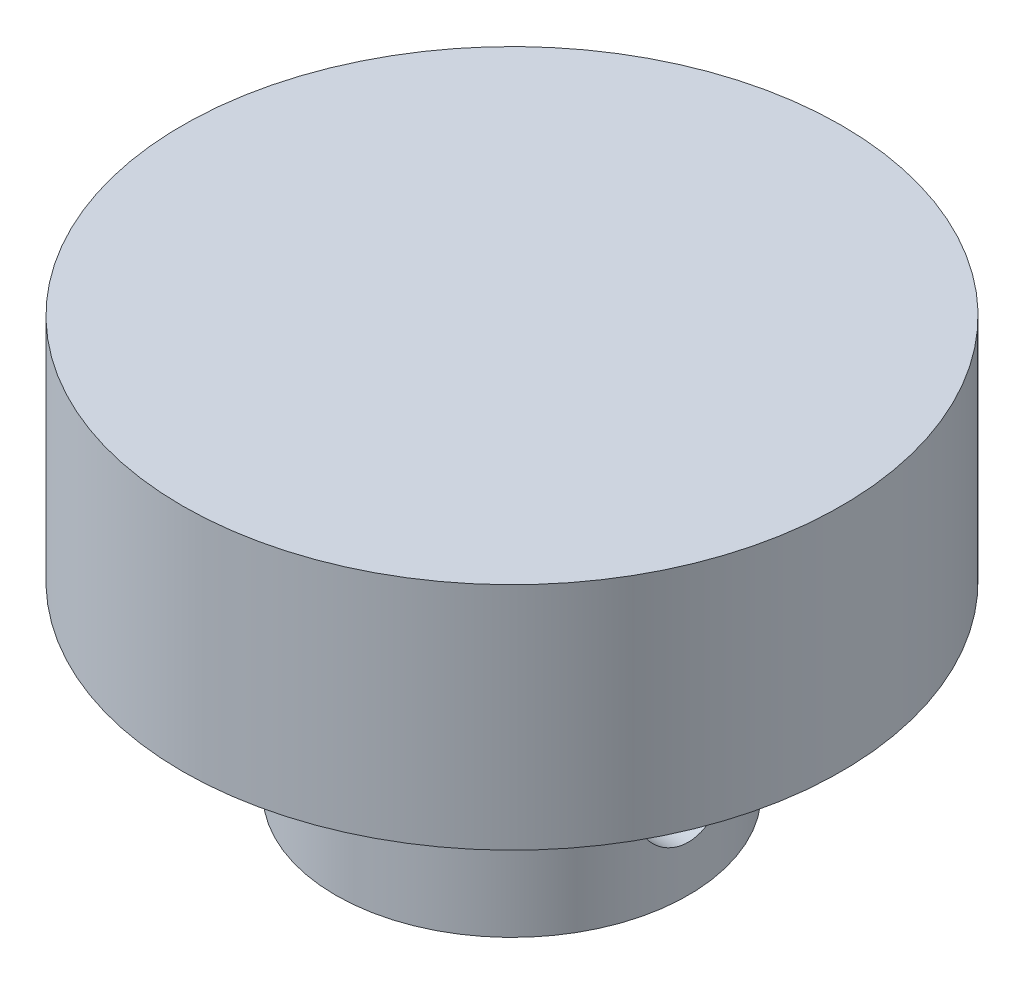
ISO-10303-21;
HEADER;
FILE_DESCRIPTION(('STEP AP214'),'2;1');
FILE_NAME('part.step','',(''),(''),'','','');
FILE_SCHEMA(('AUTOMOTIVE_DESIGN { 1 0 10303 214 1 1 1 1 }'));
ENDSEC;
DATA;
#1=APPLICATION_CONTEXT('core data for automotive mechanical design processes');
#2=APPLICATION_PROTOCOL_DEFINITION('international standard','automotive_design',2000,#1);
#3=PRODUCT_CONTEXT('',#1,'mechanical');
#4=PRODUCT('Part','Part','',(#3));
#5=PRODUCT_RELATED_PRODUCT_CATEGORY('part','',(#4));
#6=PRODUCT_DEFINITION_FORMATION('','',#4);
#7=PRODUCT_DEFINITION_CONTEXT('part definition',#1,'design');
#8=PRODUCT_DEFINITION('design','',#6,#7);
#9=PRODUCT_DEFINITION_SHAPE('','',#8);
#10=(LENGTH_UNIT() NAMED_UNIT(*) SI_UNIT(.MILLI.,.METRE.));
#11=(NAMED_UNIT(*) PLANE_ANGLE_UNIT() SI_UNIT($,.RADIAN.));
#12=(NAMED_UNIT(*) SI_UNIT($,.STERADIAN.) SOLID_ANGLE_UNIT());
#13=UNCERTAINTY_MEASURE_WITH_UNIT(LENGTH_MEASURE(1.E-05),#10,'distance_accuracy_value','');
#14=(GEOMETRIC_REPRESENTATION_CONTEXT(3) GLOBAL_UNCERTAINTY_ASSIGNED_CONTEXT((#13)) GLOBAL_UNIT_ASSIGNED_CONTEXT((#10,
#11,#12)) REPRESENTATION_CONTEXT('',''));
#15=CARTESIAN_POINT('',(0.,0.,0.));
#16=DIRECTION('',(0.,0.,1.));
#17=DIRECTION('',(1.,0.,0.));
#18=AXIS2_PLACEMENT_3D('',#15,#16,#17);
#19=CARTESIAN_POINT('',(0.,0.,0.));
#20=DIRECTION('',(0.,-1.,0.));
#21=DIRECTION('',(0.,0.,-1.));
#22=AXIS2_PLACEMENT_3D('',#19,#20,#21);
#23=CYLINDRICAL_SURFACE('',#22,2.);
#24=CARTESIAN_POINT('',(0.,-27.,0.));
#25=DIRECTION('',(0.,-1.,0.));
#26=DIRECTION('',(0.,0.,-1.));
#27=AXIS2_PLACEMENT_3D('',#24,#25,#26);
#28=CIRCLE('',#27,2.);
#29=CARTESIAN_POINT('',(0.,-27.,-2.));
#30=VERTEX_POINT('',#29);
#31=EDGE_CURVE('E57',#30,#30,#28,.T.);
#32=ORIENTED_EDGE('',*,*,#31,.T.);
#33=EDGE_LOOP('',(#32));
#34=FACE_BOUND('',#33,.T.);
#35=CARTESIAN_POINT('',(0.,-23.2360679774998,-2.));
#36=CARTESIAN_POINT('',(-0.0976283108686207,-23.2360775346282,-1.99999453997731));
#37=CARTESIAN_POINT('',(-0.195290753708801,-23.2425807104744,-1.99278992503664));
#38=CARTESIAN_POINT('',(-0.387119911650814,-23.2673197250162,-1.96458268317731));
#39=CARTESIAN_POINT('',(-0.481280035529566,-23.2855766081271,-1.94355530587862));
#40=CARTESIAN_POINT('',(-0.662735441877684,-23.3305658582557,-1.88935861676632));
#41=CARTESIAN_POINT('',(-0.750087696737658,-23.357215617946,-1.85630718014214));
#42=CARTESIAN_POINT('',(-0.917865832346665,-23.4158409468183,-1.77934008393538));
#43=CARTESIAN_POINT('',(-0.998290269976474,-23.4478176215883,-1.73542216812163));
#44=CARTESIAN_POINT('',(-1.16364688761691,-23.5194607293203,-1.63002410007714));
#45=CARTESIAN_POINT('',(-1.2473321177172,-23.5595493609036,-1.56687435451732));
#46=CARTESIAN_POINT('',(-1.40400270887428,-23.6394482730808,-1.4281921974068));
#47=CARTESIAN_POINT('',(-1.47697752165853,-23.6792582429799,-1.3526477317708));
#48=CARTESIAN_POINT('',(-1.62064365878166,-23.7608881852375,-1.17815690494295));
#49=CARTESIAN_POINT('',(-1.68948251177567,-23.8021678584692,-1.07740643965819));
#50=CARTESIAN_POINT('',(-1.80864209549007,-23.8755848448276,-0.862470964212231));
#51=CARTESIAN_POINT('',(-1.85898351403119,-23.9077323623104,-0.748301152321702));
#52=CARTESIAN_POINT('',(-1.93355640101745,-23.9559990746473,-0.523249073480001));
#53=CARTESIAN_POINT('',(-1.96008334449556,-23.9735117561587,-0.413434725181415));
#54=CARTESIAN_POINT('',(-1.99418448928365,-23.9960974546192,-0.189695448729861));
#55=CARTESIAN_POINT('',(-2.00178255922544,-24.0011861376236,-0.0757758812858242));
#56=CARTESIAN_POINT('',(-1.99782755005095,-23.9985536172295,0.13414705023233));
#57=CARTESIAN_POINT('',(-1.98901094868294,-23.9926626491013,0.230240638008753));
#58=CARTESIAN_POINT('',(-1.95790894864109,-23.9720818279002,0.419238633271016));
#59=CARTESIAN_POINT('',(-1.93562256769646,-23.957391333131,0.512142807649725));
#60=CARTESIAN_POINT('',(-1.87880431520542,-23.9205209170374,0.692077937671169));
#61=CARTESIAN_POINT('',(-1.84432111480144,-23.8983707798268,0.779130623845962));
#62=CARTESIAN_POINT('',(-1.76444635704718,-23.8482110447629,0.946209150653556));
#63=CARTESIAN_POINT('',(-1.71905280849849,-23.8202003774516,1.0262337049694));
#64=CARTESIAN_POINT('',(-1.61202126254011,-23.756180584507,1.18828429196344));
#65=CARTESIAN_POINT('',(-1.54903247664721,-23.7196040879203,1.26919148099708));
#66=CARTESIAN_POINT('',(-1.41210132051968,-23.64400601827,1.41998807498305));
#67=CARTESIAN_POINT('',(-1.33814205406619,-23.6049807281523,1.48986013519457));
#68=CARTESIAN_POINT('',(-1.16803678978671,-23.5215004494415,1.62772235326165));
#69=CARTESIAN_POINT('',(-1.07022892028551,-23.4771432000893,1.69373593126354));
#70=CARTESIAN_POINT('',(-0.862490160779287,-23.394756108311,1.80834874945482));
#71=CARTESIAN_POINT('',(-0.752580005586102,-23.3567157153489,1.85697718654898));
#72=CARTESIAN_POINT('',(-0.555280937926897,-23.3026287030689,1.92332724567776));
#73=CARTESIAN_POINT('',(-0.470406629943125,-23.2834036457767,1.94590791747533));
#74=CARTESIAN_POINT('',(-0.296960510183161,-23.2540903978961,1.97979555580014));
#75=CARTESIAN_POINT('',(-0.20839538882738,-23.2439863678235,1.99112206964395));
#76=CARTESIAN_POINT('',(-0.0295570135585047,-23.2344755698737,2.00179400148877));
#77=CARTESIAN_POINT('',(0.0607219785201243,-23.2351153386647,2.00108729753098));
#78=CARTESIAN_POINT('',(0.239683833955045,-23.2470988036895,1.98761629716365));
#79=CARTESIAN_POINT('',(0.328365344107386,-23.2584511764885,1.97484222690381));
#80=CARTESIAN_POINT('',(0.49738941754984,-23.2892797750075,1.93899811187046));
#81=CARTESIAN_POINT('',(0.577927709002579,-23.3083318706975,1.91646174529973));
#82=CARTESIAN_POINT('',(0.734126236050299,-23.3522995853365,1.86223041628513));
#83=CARTESIAN_POINT('',(0.809784822963014,-23.3772171729463,1.83053237805351));
#84=CARTESIAN_POINT('',(0.970202003847521,-23.4361148359619,1.75163346599563));
#85=CARTESIAN_POINT('',(1.0537568115427,-23.4709108143432,1.70260028818246));
#86=CARTESIAN_POINT('',(1.21241680261729,-23.5426251480663,1.59352731501438));
#87=CARTESIAN_POINT('',(1.28751151674245,-23.5795460494754,1.53347411883827));
#88=CARTESIAN_POINT('',(1.44396234746754,-23.6607567832101,1.38876657712435));
#89=CARTESIAN_POINT('',(1.52310284824832,-23.7048945213857,1.30160386514207));
#90=CARTESIAN_POINT('',(1.66581668294029,-23.7877558184164,1.11309948866219));
#91=CARTESIAN_POINT('',(1.72940377125673,-23.8264841478946,1.011770477457));
#92=CARTESIAN_POINT('',(1.82789173891759,-23.8879082124222,0.817487474821795));
#93=CARTESIAN_POINT('',(1.86595650444037,-23.9122545811101,0.726662364886319));
#94=CARTESIAN_POINT('',(1.92860719432044,-23.9527870786704,0.538757079020513));
#95=CARTESIAN_POINT('',(1.95320450285977,-23.9689800987199,0.441682263858768));
#96=CARTESIAN_POINT('',(1.98769696383875,-23.9917836402675,0.243369392303442));
#97=CARTESIAN_POINT('',(1.99752667950668,-23.9983515085653,0.142114836924317));
#98=CARTESIAN_POINT('',(2.0016478514171,-24.0010982102906,-0.0608555465807332));
#99=CARTESIAN_POINT('',(1.99594075195618,-23.997278009389,-0.162571330953449));
#100=CARTESIAN_POINT('',(1.9703405109953,-23.9802955597732,-0.355757532528106));
#101=CARTESIAN_POINT('',(1.95150901513819,-23.9678327720986,-0.44743514307053));
#102=CARTESIAN_POINT('',(1.9017619905691,-23.9353610620693,-0.626018422997062));
#103=CARTESIAN_POINT('',(1.87084458465274,-23.915350967471,-0.71292334868689));
#104=CARTESIAN_POINT('',(1.79606129511597,-23.8679176548619,-0.885147296608352));
#105=CARTESIAN_POINT('',(1.75154969250492,-23.8401324894634,-0.970083589200266));
#106=CARTESIAN_POINT('',(1.65184935537401,-23.7797540823547,-1.13155266268318));
#107=CARTESIAN_POINT('',(1.596654232048,-23.7471579664526,-1.20808037205002));
#108=CARTESIAN_POINT('',(1.46737109766369,-23.6739293147239,-1.36329422201402));
#109=CARTESIAN_POINT('',(1.39167697632596,-23.6328391387737,-1.44042679526091));
#110=CARTESIAN_POINT('',(1.22888645845416,-23.5505335764949,-1.58160022281596));
#111=CARTESIAN_POINT('',(1.14178161116591,-23.5093181197015,-1.64563128323923));
#112=CARTESIAN_POINT('',(0.964132409244706,-23.433842135903,-1.75513253518411));
#113=CARTESIAN_POINT('',(0.874358190049655,-23.399290867419,-1.8016464689721));
#114=CARTESIAN_POINT('',(0.686715551006839,-23.3374750159102,-1.88115802340272));
#115=CARTESIAN_POINT('',(0.588863306137845,-23.310196312953,-1.91418190281333));
#116=CARTESIAN_POINT('',(0.409228531575449,-23.2719105192954,-1.95936262470908));
#117=CARTESIAN_POINT('',(0.3286917632097,-23.2586369541015,-1.97452228373248));
#118=CARTESIAN_POINT('',(0.165443599495461,-23.2407151921601,-1.99483915818926));
#119=CARTESIAN_POINT('',(0.0827340557394213,-23.2360598784148,-2.00000462703715));
#120=CARTESIAN_POINT('',(0.,-23.2360679774998,-2.));
#121=B_SPLINE_CURVE_WITH_KNOTS('',3,(#35,#36,#37,#38,#39,#40,#41,#42,#43,#44,#45,#46,#47,#48,
#49,#50,#51,#52,#53,#54,#55,#56,#57,#58,#59,#60,#61,#62,#63,#64,#65,#66,#67,#68,#69,#70,#71,#72,
#73,#74,#75,#76,#77,#78,#79,#80,#81,#82,#83,#84,#85,#86,#87,#88,#89,#90,#91,#92,#93,#94,#95,#96,
#97,#98,#99,#100,#101,#102,#103,#104,#105,#106,#107,#108,#109,#110,#111,#112,#113,#114,#115,
#116,#117,#118,#119,#120),.UNSPECIFIED.,.T.,.F.,(4,2,2,2,2,2,2,2,2,2,2,2,2,2,2,2,2,2,2,2,2,2,2,
2,2,2,2,2,2,2,2,2,2,2,2,2,2,2,2,2,2,2,4),(0.,0.292506930722153,0.585539042259288,
0.875772651216275,1.16606657266549,1.50154677068638,1.83735518436275,2.22167031006289,
2.6055542938858,2.9463748206358,3.28676536688298,3.57539534955742,3.86404638283746,
4.15155831973191,4.43912276903,4.76447525946635,5.09033414796638,5.46678703504944,
5.84260469743948,6.11126090401324,6.37944966235486,6.64880037638036,6.91836943570598,
7.17476451706936,7.43124577644957,7.73899230052352,8.04711556801509,8.42254684520963,
8.7976449057258,9.10070580611698,9.40351012888472,9.70765229266164,10.0117661844615,
10.2937678224973,10.5758132789284,10.874178629859,11.1727229593109,11.5182220628451,
11.863978504186,12.1833412579672,12.5020793664923,12.7501661630426,12.9980479966543),.UNSPECIFIED.);
#122=CARTESIAN_POINT('',(0.,-23.2360679774998,-2.));
#123=VERTEX_POINT('',#122);
#124=EDGE_CURVE('E88',#123,#123,#121,.T.);
#125=ORIENTED_EDGE('',*,*,#124,.T.);
#126=EDGE_LOOP('',(#125));
#127=FACE_BOUND('',#126,.T.);
#128=ADVANCED_FACE('F43',(#34,#127),#23,.F.);
#129=CARTESIAN_POINT('',(0.,0.,0.));
#130=DIRECTION('',(0.,-1.,0.));
#131=DIRECTION('',(0.,0.,-1.));
#132=AXIS2_PLACEMENT_3D('',#129,#130,#131);
#133=CYLINDRICAL_SURFACE('',#132,11.5);
#134=CARTESIAN_POINT('',(-11.1018016555873,-21.,3.));
#135=CARTESIAN_POINT('',(-11.1018046416681,-21.1654050237616,2.99999574781901));
#136=CARTESIAN_POINT('',(-11.1055385888146,-21.3308557545628,2.9862739870282));
#137=CARTESIAN_POINT('',(-11.1200285885836,-21.6569885718273,2.93184764187599));
#138=CARTESIAN_POINT('',(-11.1307883626702,-21.8176680838725,2.89112875740957));
#139=CARTESIAN_POINT('',(-11.1580303325578,-22.1294936470709,2.78412993626242));
#140=CARTESIAN_POINT('',(-11.1745047138183,-22.2806523857462,2.71788489213753));
#141=CARTESIAN_POINT('',(-11.2113097714373,-22.5697318285177,2.56182247025821));
#142=CARTESIAN_POINT('',(-11.2316406997192,-22.7076516669154,2.47200355242808));
#143=CARTESIAN_POINT('',(-11.2744133805517,-22.9696406800769,2.26904416505215));
#144=CARTESIAN_POINT('',(-11.2968912629679,-23.0933459843836,2.15544151418971));
#145=CARTESIAN_POINT('',(-11.3411127618239,-23.3201816553928,1.90913395855516));
#146=CARTESIAN_POINT('',(-11.3628563046717,-23.4233099650166,1.77642714622373));
#147=CARTESIAN_POINT('',(-11.4035611707643,-23.6075713950247,1.49316595449653));
#148=CARTESIAN_POINT('',(-11.4224748964669,-23.6883442880935,1.34236981412251));
#149=CARTESIAN_POINT('',(-11.4549753491794,-23.8232552734816,1.02876288500976));
#150=CARTESIAN_POINT('',(-11.4685629343453,-23.8773976569088,0.865954036804427));
#151=CARTESIAN_POINT('',(-11.4886247015949,-23.9563373821463,0.536739673077931));
#152=CARTESIAN_POINT('',(-11.4952486120864,-23.9817533234142,0.3704917699844));
#153=CARTESIAN_POINT('',(-11.5011595838329,-24.0044633374111,0.0359686742163259));
#154=CARTESIAN_POINT('',(-11.5004478222506,-24.0017619221602,-0.132306188861164));
#155=CARTESIAN_POINT('',(-11.4918779731592,-23.9687528229509,-0.461806253219182));
#156=CARTESIAN_POINT('',(-11.484192846204,-23.9391132578422,-0.623103567895696));
#157=CARTESIAN_POINT('',(-11.4627429057779,-23.8541466535866,-0.938350753963736));
#158=CARTESIAN_POINT('',(-11.4489777533824,-23.7988181824302,-1.09230021522682));
#159=CARTESIAN_POINT('',(-11.4166550310123,-23.6635222211075,-1.39020655404972));
#160=CARTESIAN_POINT('',(-11.3980526058452,-23.5833226884191,-1.53405298132852));
#161=CARTESIAN_POINT('',(-11.3580645092186,-23.4007385214412,-1.80647599780597));
#162=CARTESIAN_POINT('',(-11.3366783159438,-23.2983497253925,-1.93504971548291));
#163=CARTESIAN_POINT('',(-11.2927027234436,-23.0707342925104,-2.17726444915333));
#164=CARTESIAN_POINT('',(-11.2700964360244,-22.9449245109508,-2.29035502483112));
#165=CARTESIAN_POINT('',(-11.2267989241084,-22.6758904297271,-2.49396302118491));
#166=CARTESIAN_POINT('',(-11.2061078062925,-22.5326651609932,-2.58447918487123));
#167=CARTESIAN_POINT('',(-11.1689181104159,-22.2317127155353,-2.74076407552189));
#168=CARTESIAN_POINT('',(-11.1524440176527,-22.0739077767657,-2.80638929275415));
#169=CARTESIAN_POINT('',(-11.1258611172957,-21.7489689659287,-2.91000121073618));
#170=CARTESIAN_POINT('',(-11.1157508088869,-21.5818373035765,-2.94799442845877));
#171=CARTESIAN_POINT('',(-11.1033582796576,-21.2481218905076,-2.99432763672089));
#172=CARTESIAN_POINT('',(-11.1008600430728,-21.0816596771591,-3.00348615748074));
#173=CARTESIAN_POINT('',(-11.1033845712935,-20.7495834093271,-2.99414013174871));
#174=CARTESIAN_POINT('',(-11.1084065745196,-20.5839692706626,-2.97563838642951));
#175=CARTESIAN_POINT('',(-11.1251976544441,-20.2614033119794,-2.91221727119861));
#176=CARTESIAN_POINT('',(-11.1368423739405,-20.1043487349835,-2.86778442782072));
#177=CARTESIAN_POINT('',(-11.1654465443306,-19.7999196581102,-2.75430673419544));
#178=CARTESIAN_POINT('',(-11.1824066668623,-19.6525463843807,-2.68525877350583));
#179=CARTESIAN_POINT('',(-11.2201780868576,-19.3682232606417,-2.52283092439208));
#180=CARTESIAN_POINT('',(-11.241063253276,-19.2315598066974,-2.42896728020135));
#181=CARTESIAN_POINT('',(-11.2841551264166,-18.9756228948465,-2.22017639835021));
#182=CARTESIAN_POINT('',(-11.3063620699895,-18.8563525669245,-2.10524537788259));
#183=CARTESIAN_POINT('',(-11.3503349067264,-18.6352188967519,-1.85380657439176));
#184=CARTESIAN_POINT('',(-11.3720718556128,-18.5339247531388,-1.71679215074347));
#185=CARTESIAN_POINT('',(-11.4120266295759,-18.3557774302615,-1.42722696916738));
#186=CARTESIAN_POINT('',(-11.4302446412716,-18.278922954754,-1.27467703578644));
#187=CARTESIAN_POINT('',(-11.4609920323941,-18.1525299824902,-0.959441437408471));
#188=CARTESIAN_POINT('',(-11.4735633090077,-18.1027896962873,-0.796840961860024));
#189=CARTESIAN_POINT('',(-11.491784860586,-18.0314438116452,-0.465214293018002));
#190=CARTESIAN_POINT('',(-11.4974365985569,-18.0098322658524,-0.296189465827482));
#191=CARTESIAN_POINT('',(-11.501116503245,-17.9957165312222,0.0381598942663429));
#192=CARTESIAN_POINT('',(-11.4993638178306,-18.0023756479901,0.203447203040741));
#193=CARTESIAN_POINT('',(-11.4889239903936,-18.0426788146342,0.530462632714367));
#194=CARTESIAN_POINT('',(-11.4802370890226,-18.0763219280328,0.692190876930534));
#195=CARTESIAN_POINT('',(-11.456945044609,-18.1691733555065,1.00653701523352));
#196=CARTESIAN_POINT('',(-11.4423777301083,-18.2282184162209,1.15920611864885));
#197=CARTESIAN_POINT('',(-11.4088517835094,-18.3700512800702,1.45255760125081));
#198=CARTESIAN_POINT('',(-11.3898925567045,-18.4528422989956,1.59323835356859));
#199=CARTESIAN_POINT('',(-11.3490080955884,-18.6423022120024,1.86254087988201));
#200=CARTESIAN_POINT('',(-11.3270191162386,-18.7495304891059,1.99075942238901));
#201=CARTESIAN_POINT('',(-11.282821318698,-18.9837512779054,2.22766629387465));
#202=CARTESIAN_POINT('',(-11.2606124449277,-19.1107489123454,2.33634954498916));
#203=CARTESIAN_POINT('',(-11.2179598882197,-19.3840805190096,2.53333126849171));
#204=CARTESIAN_POINT('',(-11.1975624999878,-19.5307615875036,2.62115899195099));
#205=CARTESIAN_POINT('',(-11.1614846462572,-19.8373209755387,2.77078042280792));
#206=CARTESIAN_POINT('',(-11.1458009729192,-19.9971902252286,2.83259184668349));
#207=CARTESIAN_POINT('',(-11.1232017724301,-20.2971525728509,2.91993765526439));
#208=CARTESIAN_POINT('',(-11.1152400200808,-20.4358956508644,2.9498923670659));
#209=CARTESIAN_POINT('',(-11.1045389509216,-20.7164148299402,2.98992433717078));
#210=CARTESIAN_POINT('',(-11.101799095482,-20.8581906166581,3.00000364559159));
#211=CARTESIAN_POINT('',(-11.1018016555873,-21.,3.));
#212=B_SPLINE_CURVE_WITH_KNOTS('',3,(#134,#135,#136,#137,#138,#139,#140,#141,#142,#143,#144,
#145,#146,#147,#148,#149,#150,#151,#152,#153,#154,#155,#156,#157,#158,#159,#160,#161,#162,#163,
#164,#165,#166,#167,#168,#169,#170,#171,#172,#173,#174,#175,#176,#177,#178,#179,#180,#181,#182,
#183,#184,#185,#186,#187,#188,#189,#190,#191,#192,#193,#194,#195,#196,#197,#198,#199,#200,#201,
#202,#203,#204,#205,#206,#207,#208,#209,#210,#211),.UNSPECIFIED.,.T.,.F.,(4,2,2,2,2,2,2,2,2,2,2,
2,2,2,2,2,2,2,2,2,2,2,2,2,2,2,2,2,2,2,2,2,2,2,2,2,2,2,4),(0.,0.495693864426937,
0.991650502901441,1.4869315930392,1.98224504783315,2.4882659798999,2.99433747348055,
3.5081429991003,4.0218657055059,4.52430149755158,5.02665666447218,5.51688263581214,
6.00713593772637,6.50210829427883,6.99717356700053,7.50680002907636,8.0164548618693,
8.52900500910673,9.04143423279153,9.53917954400053,10.0368744516405,10.5255187110587,
11.0142247389737,11.5132674061231,12.0123997681006,12.5252646912173,13.0381024082112,
13.5470694807036,14.0559289230968,14.5498348761799,15.0437236890362,15.5344847111833,
16.0253122259277,16.528764120949,17.0323466910099,17.5463982140932,18.0600991117908,
18.4851242500374,18.9101055452975),.UNSPECIFIED.);
#213=CARTESIAN_POINT('',(-11.1018016555873,-21.,3.));
#214=VERTEX_POINT('',#213);
#215=EDGE_CURVE('E66',#214,#214,#212,.T.);
#216=ORIENTED_EDGE('',*,*,#215,.T.);
#217=EDGE_LOOP('',(#216));
#218=FACE_BOUND('',#217,.T.);
#219=CARTESIAN_POINT('',(0.,-15.,0.));
#220=DIRECTION('',(0.,-1.,0.));
#221=DIRECTION('',(0.,0.,-1.));
#222=AXIS2_PLACEMENT_3D('',#219,#220,#221);
#223=CIRCLE('',#222,11.5);
#224=CARTESIAN_POINT('',(0.,-15.,-11.5));
#225=VERTEX_POINT('',#224);
#226=EDGE_CURVE('E136',#225,#225,#223,.T.);
#227=ORIENTED_EDGE('',*,*,#226,.T.);
#228=EDGE_LOOP('',(#227));
#229=FACE_BOUND('',#228,.T.);
#230=CARTESIAN_POINT('',(0.,-27.,0.));
#231=DIRECTION('',(0.,-1.,0.));
#232=DIRECTION('',(0.,0.,-1.));
#233=AXIS2_PLACEMENT_3D('',#230,#231,#232);
#234=CIRCLE('',#233,11.5);
#235=CARTESIAN_POINT('',(0.,-27.,-11.5));
#236=VERTEX_POINT('',#235);
#237=EDGE_CURVE('E63',#236,#236,#234,.T.);
#238=ORIENTED_EDGE('',*,*,#237,.F.);
#239=EDGE_LOOP('',(#238));
#240=FACE_BOUND('',#239,.T.);
#241=CARTESIAN_POINT('',(11.1018016555873,-21.,3.));
#242=CARTESIAN_POINT('',(11.1018046416681,-20.8345949762384,2.99999574781901));
#243=CARTESIAN_POINT('',(11.1055385888146,-20.6691442454372,2.9862739870282));
#244=CARTESIAN_POINT('',(11.1200285885836,-20.3430114281727,2.93184764187599));
#245=CARTESIAN_POINT('',(11.1307883626702,-20.1823319161275,2.89112875740957));
#246=CARTESIAN_POINT('',(11.1580303325578,-19.8705063529291,2.78412993626242));
#247=CARTESIAN_POINT('',(11.1745047138183,-19.7193476142538,2.71788489213753));
#248=CARTESIAN_POINT('',(11.2113097714373,-19.4302681714823,2.56182247025821));
#249=CARTESIAN_POINT('',(11.2316406997192,-19.2923483330846,2.47200355242808));
#250=CARTESIAN_POINT('',(11.2744133805517,-19.0303593199231,2.26904416505215));
#251=CARTESIAN_POINT('',(11.2968912629679,-18.9066540156165,2.15544151418971));
#252=CARTESIAN_POINT('',(11.3411127618239,-18.6798183446072,1.90913395855516));
#253=CARTESIAN_POINT('',(11.3628563046717,-18.5766900349835,1.77642714622373));
#254=CARTESIAN_POINT('',(11.4035611707643,-18.3924286049753,1.49316595449653));
#255=CARTESIAN_POINT('',(11.4224748964669,-18.3116557119065,1.34236981412251));
#256=CARTESIAN_POINT('',(11.4549753491794,-18.1767447265184,1.02876288500976));
#257=CARTESIAN_POINT('',(11.4685629343453,-18.1226023430912,0.865954036804427));
#258=CARTESIAN_POINT('',(11.4886247015949,-18.0436626178537,0.536739673077931));
#259=CARTESIAN_POINT('',(11.4952486120864,-18.0182466765859,0.3704917699844));
#260=CARTESIAN_POINT('',(11.5011595838329,-17.9955366625889,0.0359686742163259));
#261=CARTESIAN_POINT('',(11.5004478222506,-17.9982380778398,-0.132306188861164));
#262=CARTESIAN_POINT('',(11.4918779731592,-18.0312471770491,-0.461806253219182));
#263=CARTESIAN_POINT('',(11.484192846204,-18.0608867421578,-0.623103567895696));
#264=CARTESIAN_POINT('',(11.4627429057779,-18.1458533464134,-0.938350753963736));
#265=CARTESIAN_POINT('',(11.4489777533824,-18.2011818175698,-1.09230021522682));
#266=CARTESIAN_POINT('',(11.4166550310123,-18.3364777788925,-1.39020655404972));
#267=CARTESIAN_POINT('',(11.3980526058452,-18.4166773115809,-1.53405298132852));
#268=CARTESIAN_POINT('',(11.3580645092186,-18.5992614785589,-1.80647599780597));
#269=CARTESIAN_POINT('',(11.3366783159438,-18.7016502746076,-1.93504971548291));
#270=CARTESIAN_POINT('',(11.2927027234436,-18.9292657074896,-2.17726444915333));
#271=CARTESIAN_POINT('',(11.2700964360244,-19.0550754890492,-2.29035502483112));
#272=CARTESIAN_POINT('',(11.2267989241084,-19.3241095702729,-2.49396302118491));
#273=CARTESIAN_POINT('',(11.2061078062925,-19.4673348390068,-2.58447918487123));
#274=CARTESIAN_POINT('',(11.1689181104159,-19.7682872844647,-2.74076407552189));
#275=CARTESIAN_POINT('',(11.1524440176527,-19.9260922232343,-2.80638929275416));
#276=CARTESIAN_POINT('',(11.1258611172957,-20.2510310340713,-2.91000121073618));
#277=CARTESIAN_POINT('',(11.1157508088869,-20.4181626964235,-2.94799442845877));
#278=CARTESIAN_POINT('',(11.1033582796576,-20.7518781094924,-2.99432763672089));
#279=CARTESIAN_POINT('',(11.1008600430728,-20.9183403228409,-3.00348615748074));
#280=CARTESIAN_POINT('',(11.1033845712935,-21.250416590673,-2.99414013174871));
#281=CARTESIAN_POINT('',(11.1084065745196,-21.4160307293374,-2.97563838642951));
#282=CARTESIAN_POINT('',(11.1251976544441,-21.7385966880206,-2.91221727119861));
#283=CARTESIAN_POINT('',(11.1368423739405,-21.8956512650165,-2.86778442782072));
#284=CARTESIAN_POINT('',(11.1654465443306,-22.2000803418898,-2.75430673419544));
#285=CARTESIAN_POINT('',(11.1824066668623,-22.3474536156193,-2.68525877350583));
#286=CARTESIAN_POINT('',(11.2201780868576,-22.6317767393583,-2.52283092439208));
#287=CARTESIAN_POINT('',(11.241063253276,-22.7684401933026,-2.42896728020135));
#288=CARTESIAN_POINT('',(11.2841551264166,-23.0243771051535,-2.22017639835021));
#289=CARTESIAN_POINT('',(11.3063620699895,-23.1436474330755,-2.10524537788259));
#290=CARTESIAN_POINT('',(11.3503349067264,-23.3647811032481,-1.85380657439176));
#291=CARTESIAN_POINT('',(11.3720718556128,-23.4660752468612,-1.71679215074347));
#292=CARTESIAN_POINT('',(11.4120266295759,-23.6442225697385,-1.42722696916738));
#293=CARTESIAN_POINT('',(11.4302446412716,-23.721077045246,-1.27467703578644));
#294=CARTESIAN_POINT('',(11.4609920323941,-23.8474700175098,-0.959441437408471));
#295=CARTESIAN_POINT('',(11.4735633090077,-23.8972103037127,-0.796840961860024));
#296=CARTESIAN_POINT('',(11.491784860586,-23.9685561883548,-0.465214293018002));
#297=CARTESIAN_POINT('',(11.4974365985569,-23.9901677341476,-0.296189465827482));
#298=CARTESIAN_POINT('',(11.501116503245,-24.0042834687778,0.0381598942663429));
#299=CARTESIAN_POINT('',(11.4993638178306,-23.9976243520099,0.203447203040741));
#300=CARTESIAN_POINT('',(11.4889239903936,-23.9573211853658,0.530462632714367));
#301=CARTESIAN_POINT('',(11.4802370890226,-23.9236780719672,0.692190876930534));
#302=CARTESIAN_POINT('',(11.456945044609,-23.8308266444935,1.00653701523352));
#303=CARTESIAN_POINT('',(11.4423777301083,-23.7717815837791,1.15920611864885));
#304=CARTESIAN_POINT('',(11.4088517835094,-23.6299487199298,1.45255760125081));
#305=CARTESIAN_POINT('',(11.3898925567045,-23.5471577010044,1.59323835356859));
#306=CARTESIAN_POINT('',(11.3490080955884,-23.3576977879976,1.86254087988201));
#307=CARTESIAN_POINT('',(11.3270191162385,-23.2504695108941,1.99075942238901));
#308=CARTESIAN_POINT('',(11.2828213186979,-23.0162487220946,2.22766629387464));
#309=CARTESIAN_POINT('',(11.2606124449277,-22.8892510876546,2.33634954498916));
#310=CARTESIAN_POINT('',(11.2179598882197,-22.6159194809904,2.53333126849171));
#311=CARTESIAN_POINT('',(11.1975624999878,-22.4692384124964,2.62115899195099));
#312=CARTESIAN_POINT('',(11.1614846462572,-22.1626790244613,2.77078042280792));
#313=CARTESIAN_POINT('',(11.1458009729192,-22.0028097747714,2.83259184668349));
#314=CARTESIAN_POINT('',(11.1232017724301,-21.7028474271491,2.91993765526439));
#315=CARTESIAN_POINT('',(11.1152400200808,-21.5641043491356,2.9498923670659));
#316=CARTESIAN_POINT('',(11.1045389509216,-21.2835851700598,2.98992433717078));
#317=CARTESIAN_POINT('',(11.101799095482,-21.1418093833419,3.00000364559159));
#318=CARTESIAN_POINT('',(11.1018016555873,-21.,3.));
#319=B_SPLINE_CURVE_WITH_KNOTS('',3,(#241,#242,#243,#244,#245,#246,#247,#248,#249,#250,#251,
#252,#253,#254,#255,#256,#257,#258,#259,#260,#261,#262,#263,#264,#265,#266,#267,#268,#269,#270,
#271,#272,#273,#274,#275,#276,#277,#278,#279,#280,#281,#282,#283,#284,#285,#286,#287,#288,#289,
#290,#291,#292,#293,#294,#295,#296,#297,#298,#299,#300,#301,#302,#303,#304,#305,#306,#307,#308,
#309,#310,#311,#312,#313,#314,#315,#316,#317,#318),.UNSPECIFIED.,.T.,.F.,(4,2,2,2,2,2,2,2,2,2,2,
2,2,2,2,2,2,2,2,2,2,2,2,2,2,2,2,2,2,2,2,2,2,2,2,2,2,2,4),(0.,0.495693864426934,
0.991650502901441,1.4869315930392,1.98224504783315,2.4882659798999,2.99433747348055,
3.5081429991003,4.0218657055059,4.52430149755158,5.02665666447218,5.51688263581214,
6.00713593772637,6.50210829427883,6.99717356700053,7.50680002907636,8.0164548618693,
8.52900500910673,9.04143423279153,9.53917954400053,10.0368744516405,10.5255187110587,
11.0142247389737,11.5132674061231,12.0123997681006,12.5252646912173,13.0381024082112,
13.5470694807036,14.0559289230968,14.5498348761799,15.0437236890362,15.5344847111833,
16.0253122259277,16.528764120949,17.0323466910099,17.5463982140932,18.0600991117908,
18.4851242500374,18.9101055452975),.UNSPECIFIED.);
#320=CARTESIAN_POINT('',(11.1018016555873,-21.,3.));
#321=VERTEX_POINT('',#320);
#322=EDGE_CURVE('E47',#321,#321,#319,.T.);
#323=ORIENTED_EDGE('',*,*,#322,.T.);
#324=EDGE_LOOP('',(#323));
#325=FACE_BOUND('',#324,.T.);
#326=ADVANCED_FACE('F72',(#218,#229,#240,#325),#133,.T.);
#327=CARTESIAN_POINT('',(0.,-27.,-11.5));
#328=DIRECTION('',(0.,-1.,0.));
#329=DIRECTION('',(0.,0.,-1.));
#330=AXIS2_PLACEMENT_3D('',#327,#328,#329);
#331=PLANE('',#330);
#332=ORIENTED_EDGE('',*,*,#237,.T.);
#333=EDGE_LOOP('',(#332));
#334=FACE_BOUND('',#333,.T.);
#335=ORIENTED_EDGE('',*,*,#31,.F.);
#336=EDGE_LOOP('',(#335));
#337=FACE_BOUND('',#336,.T.);
#338=ADVANCED_FACE('F103',(#334,#337),#331,.T.);
#339=CARTESIAN_POINT('',(0.,-15.,-21.5));
#340=DIRECTION('',(0.,-1.,0.));
#341=DIRECTION('',(0.,0.,-1.));
#342=AXIS2_PLACEMENT_3D('',#339,#340,#341);
#343=PLANE('',#342);
#344=CARTESIAN_POINT('',(0.,-15.,0.));
#345=DIRECTION('',(0.,-1.,0.));
#346=DIRECTION('',(0.,0.,-1.));
#347=AXIS2_PLACEMENT_3D('',#344,#345,#346);
#348=CIRCLE('',#347,21.5);
#349=CARTESIAN_POINT('',(0.,-15.,-21.5));
#350=VERTEX_POINT('',#349);
#351=EDGE_CURVE('E146',#350,#350,#348,.T.);
#352=ORIENTED_EDGE('',*,*,#351,.T.);
#353=EDGE_LOOP('',(#352));
#354=FACE_BOUND('',#353,.T.);
#355=ORIENTED_EDGE('',*,*,#226,.F.);
#356=EDGE_LOOP('',(#355));
#357=FACE_BOUND('',#356,.T.);
#358=ADVANCED_FACE('F106',(#354,#357),#343,.T.);
#359=CARTESIAN_POINT('',(0.,0.,0.));
#360=DIRECTION('',(0.,-1.,0.));
#361=DIRECTION('',(0.,0.,-1.));
#362=AXIS2_PLACEMENT_3D('',#359,#360,#361);
#363=CYLINDRICAL_SURFACE('',#362,21.5);
#364=CARTESIAN_POINT('',(0.,0.,0.));
#365=DIRECTION('',(0.,-1.,0.));
#366=DIRECTION('',(0.,0.,-1.));
#367=AXIS2_PLACEMENT_3D('',#364,#365,#366);
#368=CIRCLE('',#367,21.5);
#369=CARTESIAN_POINT('',(0.,0.,-21.5));
#370=VERTEX_POINT('',#369);
#371=EDGE_CURVE('E143',#370,#370,#368,.T.);
#372=ORIENTED_EDGE('',*,*,#371,.T.);
#373=EDGE_LOOP('',(#372));
#374=FACE_BOUND('',#373,.T.);
#375=ORIENTED_EDGE('',*,*,#351,.F.);
#376=EDGE_LOOP('',(#375));
#377=FACE_BOUND('',#376,.T.);
#378=ADVANCED_FACE('F112',(#374,#377),#363,.T.);
#379=CARTESIAN_POINT('',(0.,0.,-2.));
#380=DIRECTION('',(0.,1.,0.));
#381=DIRECTION('',(0.,0.,1.));
#382=AXIS2_PLACEMENT_3D('',#379,#380,#381);
#383=PLANE('',#382);
#384=ORIENTED_EDGE('',*,*,#371,.F.);
#385=EDGE_LOOP('',(#384));
#386=FACE_BOUND('',#385,.T.);
#387=ADVANCED_FACE('F80',(#386),#383,.T.);
#388=CARTESIAN_POINT('',(15.,-21.,0.));
#389=DIRECTION('',(-1.,0.,0.));
#390=DIRECTION('',(0.,0.,1.));
#391=AXIS2_PLACEMENT_3D('',#388,#389,#390);
#392=CYLINDRICAL_SURFACE('',#391,3.);
#393=CARTESIAN_POINT('',(0.,-18.7639320225002,-2.));
#394=CARTESIAN_POINT('',(0.0976283108686207,-18.7639224653718,-1.99999453997731));
#395=CARTESIAN_POINT('',(0.195290753708801,-18.7574192895256,-1.99278992503664));
#396=CARTESIAN_POINT('',(0.387119911650814,-18.7326802749838,-1.96458268317731));
#397=CARTESIAN_POINT('',(0.481280035529566,-18.7144233918729,-1.94355530587862));
#398=CARTESIAN_POINT('',(0.662735441877684,-18.6694341417443,-1.88935861676632));
#399=CARTESIAN_POINT('',(0.750087696737658,-18.642784382054,-1.85630718014214));
#400=CARTESIAN_POINT('',(0.917865832346665,-18.5841590531818,-1.77934008393538));
#401=CARTESIAN_POINT('',(0.998290269976474,-18.5521823784117,-1.73542216812163));
#402=CARTESIAN_POINT('',(1.16364688761691,-18.4805392706797,-1.63002410007714));
#403=CARTESIAN_POINT('',(1.2473321177172,-18.4404506390964,-1.56687435451732));
#404=CARTESIAN_POINT('',(1.40400270887428,-18.3605517269192,-1.4281921974068));
#405=CARTESIAN_POINT('',(1.47697752165853,-18.3207417570202,-1.3526477317708));
#406=CARTESIAN_POINT('',(1.62064365878166,-18.2391118147625,-1.17815690494295));
#407=CARTESIAN_POINT('',(1.68948251177567,-18.1978321415308,-1.07740643965819));
#408=CARTESIAN_POINT('',(1.80864209549007,-18.1244151551724,-0.862470964212231));
#409=CARTESIAN_POINT('',(1.85898351403119,-18.0922676376896,-0.748301152321702));
#410=CARTESIAN_POINT('',(1.93355640101745,-18.0440009253528,-0.523249073480001));
#411=CARTESIAN_POINT('',(1.96008334449556,-18.0264882438413,-0.413434725181414));
#412=CARTESIAN_POINT('',(1.99418448928365,-18.0039025453808,-0.189695448729861));
#413=CARTESIAN_POINT('',(2.00178255922544,-17.9988138623764,-0.0757758812858241));
#414=CARTESIAN_POINT('',(1.99782755005095,-18.0014463827705,0.13414705023233));
#415=CARTESIAN_POINT('',(1.98901094868294,-18.0073373508987,0.230240638008753));
#416=CARTESIAN_POINT('',(1.95790894864109,-18.0279181720998,0.419238633271016));
#417=CARTESIAN_POINT('',(1.93562256769646,-18.042608666869,0.512142807649725));
#418=CARTESIAN_POINT('',(1.87880431520542,-18.0794790829626,0.692077937671169));
#419=CARTESIAN_POINT('',(1.84432111480144,-18.1016292201732,0.779130623845962));
#420=CARTESIAN_POINT('',(1.76444635704718,-18.1517889552371,0.946209150653556));
#421=CARTESIAN_POINT('',(1.71905280849849,-18.1797996225484,1.0262337049694));
#422=CARTESIAN_POINT('',(1.61202126254011,-18.243819415493,1.18828429196344));
#423=CARTESIAN_POINT('',(1.54903247664721,-18.2803959120798,1.26919148099708));
#424=CARTESIAN_POINT('',(1.41210132051968,-18.35599398173,1.41998807498305));
#425=CARTESIAN_POINT('',(1.33814205406619,-18.3950192718477,1.48986013519457));
#426=CARTESIAN_POINT('',(1.16803678978671,-18.4784995505585,1.62772235326165));
#427=CARTESIAN_POINT('',(1.07022892028551,-18.5228567999107,1.69373593126354));
#428=CARTESIAN_POINT('',(0.862490160779287,-18.605243891689,1.80834874945482));
#429=CARTESIAN_POINT('',(0.752580005586102,-18.6432842846511,1.85697718654898));
#430=CARTESIAN_POINT('',(0.555280937926897,-18.6973712969311,1.92332724567776));
#431=CARTESIAN_POINT('',(0.470406629943125,-18.7165963542233,1.94590791747533));
#432=CARTESIAN_POINT('',(0.296960510183161,-18.7459096021039,1.97979555580014));
#433=CARTESIAN_POINT('',(0.20839538882738,-18.7560136321765,1.99112206964395));
#434=CARTESIAN_POINT('',(0.0295570135585047,-18.7655244301263,2.00179400148877));
#435=CARTESIAN_POINT('',(-0.0607219785201243,-18.7648846613353,2.00108729753098));
#436=CARTESIAN_POINT('',(-0.239683833955045,-18.7529011963105,1.98761629716365));
#437=CARTESIAN_POINT('',(-0.328365344107386,-18.7415488235115,1.97484222690381));
#438=CARTESIAN_POINT('',(-0.497389417549839,-18.7107202249925,1.93899811187046));
#439=CARTESIAN_POINT('',(-0.577927709002577,-18.6916681293025,1.91646174529973));
#440=CARTESIAN_POINT('',(-0.734126236050298,-18.6477004146635,1.86223041628513));
#441=CARTESIAN_POINT('',(-0.809784822963013,-18.6227828270537,1.83053237805351));
#442=CARTESIAN_POINT('',(-0.97020200384752,-18.5638851640381,1.75163346599563));
#443=CARTESIAN_POINT('',(-1.0537568115427,-18.5290891856568,1.70260028818246));
#444=CARTESIAN_POINT('',(-1.21241680261729,-18.4573748519337,1.59352731501438));
#445=CARTESIAN_POINT('',(-1.28751151674245,-18.4204539505246,1.53347411883827));
#446=CARTESIAN_POINT('',(-1.44396234746754,-18.3392432167899,1.38876657712435));
#447=CARTESIAN_POINT('',(-1.52310284824832,-18.2951054786143,1.30160386514207));
#448=CARTESIAN_POINT('',(-1.66581668294029,-18.2122441815836,1.11309948866219));
#449=CARTESIAN_POINT('',(-1.72940377125673,-18.1735158521054,1.011770477457));
#450=CARTESIAN_POINT('',(-1.82789173891759,-18.1120917875778,0.817487474821795));
#451=CARTESIAN_POINT('',(-1.86595650444037,-18.0877454188899,0.726662364886318));
#452=CARTESIAN_POINT('',(-1.92860719432044,-18.0472129213296,0.538757079020513));
#453=CARTESIAN_POINT('',(-1.95320450285977,-18.0310199012801,0.441682263858768));
#454=CARTESIAN_POINT('',(-1.98769696383875,-18.0082163597325,0.243369392303442));
#455=CARTESIAN_POINT('',(-1.99752667950668,-18.0016484914347,0.142114836924317));
#456=CARTESIAN_POINT('',(-2.0016478514171,-17.9989017897094,-0.0608555465807332));
#457=CARTESIAN_POINT('',(-1.99594075195618,-18.002721990611,-0.162571330953449));
#458=CARTESIAN_POINT('',(-1.9703405109953,-18.0197044402268,-0.355757532528106));
#459=CARTESIAN_POINT('',(-1.95150901513819,-18.0321672279014,-0.44743514307053));
#460=CARTESIAN_POINT('',(-1.9017619905691,-18.0646389379307,-0.626018422997062));
#461=CARTESIAN_POINT('',(-1.87084458465274,-18.084649032529,-0.712923348686891));
#462=CARTESIAN_POINT('',(-1.79606129511597,-18.1320823451381,-0.885147296608352));
#463=CARTESIAN_POINT('',(-1.75154969250492,-18.1598675105366,-0.970083589200266));
#464=CARTESIAN_POINT('',(-1.65184935537401,-18.2202459176453,-1.13155266268318));
#465=CARTESIAN_POINT('',(-1.596654232048,-18.2528420335474,-1.20808037205002));
#466=CARTESIAN_POINT('',(-1.46737109766369,-18.3260706852761,-1.36329422201402));
#467=CARTESIAN_POINT('',(-1.39167697632596,-18.3671608612263,-1.44042679526091));
#468=CARTESIAN_POINT('',(-1.22888645845416,-18.4494664235051,-1.58160022281596));
#469=CARTESIAN_POINT('',(-1.14178161116591,-18.4906818802985,-1.64563128323923));
#470=CARTESIAN_POINT('',(-0.964132409244706,-18.566157864097,-1.75513253518411));
#471=CARTESIAN_POINT('',(-0.874358190049655,-18.600709132581,-1.8016464689721));
#472=CARTESIAN_POINT('',(-0.686715551006839,-18.6625249840898,-1.88115802340272));
#473=CARTESIAN_POINT('',(-0.588863306137845,-18.689803687047,-1.91418190281333));
#474=CARTESIAN_POINT('',(-0.409228531575449,-18.7280894807046,-1.95936262470908));
#475=CARTESIAN_POINT('',(-0.3286917632097,-18.7413630458985,-1.97452228373248));
#476=CARTESIAN_POINT('',(-0.165443599495461,-18.7592848078399,-1.99483915818926));
#477=CARTESIAN_POINT('',(-0.0827340557394213,-18.7639401215853,-2.00000462703715));
#478=CARTESIAN_POINT('',(0.,-18.7639320225002,-2.));
#479=B_SPLINE_CURVE_WITH_KNOTS('',3,(#393,#394,#395,#396,#397,#398,#399,#400,#401,#402,#403,
#404,#405,#406,#407,#408,#409,#410,#411,#412,#413,#414,#415,#416,#417,#418,#419,#420,#421,#422,
#423,#424,#425,#426,#427,#428,#429,#430,#431,#432,#433,#434,#435,#436,#437,#438,#439,#440,#441,
#442,#443,#444,#445,#446,#447,#448,#449,#450,#451,#452,#453,#454,#455,#456,#457,#458,#459,#460,
#461,#462,#463,#464,#465,#466,#467,#468,#469,#470,#471,#472,#473,#474,#475,#476,#477,#478),
.UNSPECIFIED.,.T.,.F.,(4,2,2,2,2,2,2,2,2,2,2,2,2,2,2,2,2,2,2,2,2,2,2,2,2,2,2,2,2,2,2,2,2,2,2,2,
2,2,2,2,2,2,4),(0.,0.292506930722153,0.585539042259288,0.875772651216275,1.16606657266549,
1.50154677068638,1.83735518436275,2.22167031006289,2.6055542938858,2.9463748206358,
3.28676536688298,3.57539534955742,3.86404638283746,4.15155831973191,4.43912276903,
4.76447525946635,5.09033414796638,5.46678703504944,5.84260469743948,6.11126090401324,
6.37944966235486,6.64880037638036,6.91836943570597,7.17476451706936,7.43124577644957,
7.73899230052352,8.04711556801509,8.42254684520963,8.7976449057258,9.10070580611698,
9.40351012888472,9.70765229266164,10.0117661844615,10.2937678224973,10.5758132789284,
10.874178629859,11.1727229593109,11.5182220628451,11.863978504186,12.1833412579672,
12.5020793664923,12.7501661630426,12.9980479966543),.UNSPECIFIED.);
#480=CARTESIAN_POINT('',(0.,-18.7639320225002,-2.));
#481=VERTEX_POINT('',#480);
#482=EDGE_CURVE('E94',#481,#481,#479,.T.);
#483=ORIENTED_EDGE('',*,*,#482,.F.);
#484=EDGE_LOOP('',(#483));
#485=FACE_BOUND('',#484,.T.);
#486=ORIENTED_EDGE('',*,*,#124,.F.);
#487=EDGE_LOOP('',(#486));
#488=FACE_BOUND('',#487,.T.);
#489=ORIENTED_EDGE('',*,*,#322,.F.);
#490=EDGE_LOOP('',(#489));
#491=FACE_BOUND('',#490,.T.);
#492=ORIENTED_EDGE('',*,*,#215,.F.);
#493=EDGE_LOOP('',(#492));
#494=FACE_BOUND('',#493,.T.);
#495=ADVANCED_FACE('F76',(#485,#488,#491,#494),#392,.F.);
#496=CARTESIAN_POINT('',(0.,-15.0000000000216,0.));
#497=DIRECTION('',(0.,-1.,0.));
#498=DIRECTION('',(0.,0.,-1.));
#499=AXIS2_PLACEMENT_3D('',#496,#497,#498);
#500=PLANE('',#499);
#501=CARTESIAN_POINT('',(0.,-15.0000000000216,0.));
#502=DIRECTION('',(0.,-1.,0.));
#503=DIRECTION('',(0.,0.,-1.));
#504=AXIS2_PLACEMENT_3D('',#501,#502,#503);
#505=CIRCLE('',#504,2.);
#506=CARTESIAN_POINT('',(0.,-15.0000000000216,-2.));
#507=VERTEX_POINT('',#506);
#508=EDGE_CURVE('E10',#507,#507,#505,.T.);
#509=ORIENTED_EDGE('',*,*,#508,.T.);
#510=EDGE_LOOP('',(#509));
#511=FACE_BOUND('',#510,.T.);
#512=ADVANCED_FACE('F45',(#511),#500,.T.);
#513=ORIENTED_EDGE('',*,*,#508,.F.);
#514=EDGE_LOOP('',(#513));
#515=FACE_BOUND('',#514,.T.);
#516=ORIENTED_EDGE('',*,*,#482,.T.);
#517=EDGE_LOOP('',(#516));
#518=FACE_BOUND('',#517,.T.);
#519=ADVANCED_FACE('F99',(#515,#518),#23,.F.);
#520=CLOSED_SHELL('',(#128,#326,#338,#358,#378,#387,#495,#512,#519));
#521=MANIFOLD_SOLID_BREP('B2',#520);
#522=ADVANCED_BREP_SHAPE_REPRESENTATION('',(#18,#521),#14);
#523=SHAPE_DEFINITION_REPRESENTATION(#9,#522);
ENDSEC;
END-ISO-10303-21;
